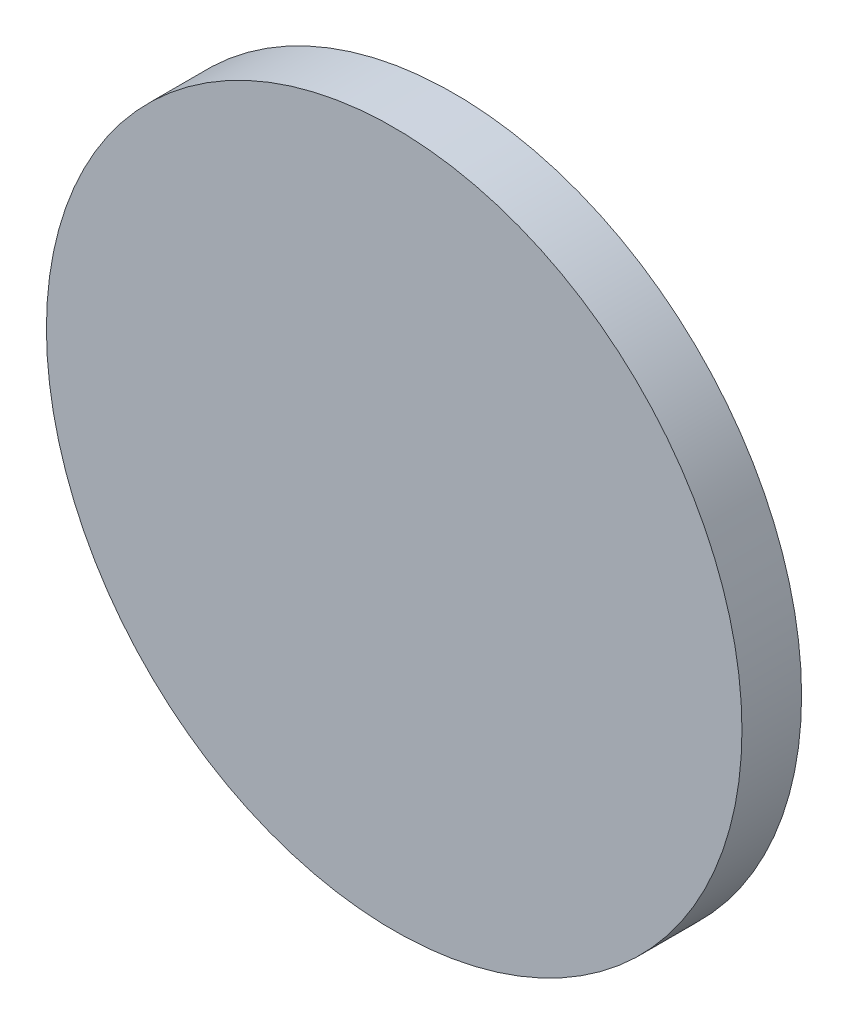
ISO-10303-21;
HEADER;
FILE_DESCRIPTION(('STEP AP214'),'2;1');
FILE_NAME('part.step','',(''),(''),'','','');
FILE_SCHEMA(('AUTOMOTIVE_DESIGN { 1 0 10303 214 1 1 1 1 }'));
ENDSEC;
DATA;
#1=APPLICATION_CONTEXT('core data for automotive mechanical design processes');
#2=APPLICATION_PROTOCOL_DEFINITION('international standard','automotive_design',2000,#1);
#3=PRODUCT_CONTEXT('',#1,'mechanical');
#4=PRODUCT('Part','Part','',(#3));
#5=PRODUCT_RELATED_PRODUCT_CATEGORY('part','',(#4));
#6=PRODUCT_DEFINITION_FORMATION('','',#4);
#7=PRODUCT_DEFINITION_CONTEXT('part definition',#1,'design');
#8=PRODUCT_DEFINITION('design','',#6,#7);
#9=PRODUCT_DEFINITION_SHAPE('','',#8);
#10=(LENGTH_UNIT() NAMED_UNIT(*) SI_UNIT(.MILLI.,.METRE.));
#11=(NAMED_UNIT(*) PLANE_ANGLE_UNIT() SI_UNIT($,.RADIAN.));
#12=(NAMED_UNIT(*) SI_UNIT($,.STERADIAN.) SOLID_ANGLE_UNIT());
#13=UNCERTAINTY_MEASURE_WITH_UNIT(LENGTH_MEASURE(1.E-05),#10,'distance_accuracy_value','');
#14=(GEOMETRIC_REPRESENTATION_CONTEXT(3) GLOBAL_UNCERTAINTY_ASSIGNED_CONTEXT((#13)) GLOBAL_UNIT_ASSIGNED_CONTEXT((#10,
#11,#12)) REPRESENTATION_CONTEXT('',''));
#15=CARTESIAN_POINT('',(0.,0.,0.));
#16=DIRECTION('',(0.,0.,1.));
#17=DIRECTION('',(1.,0.,0.));
#18=AXIS2_PLACEMENT_3D('',#15,#16,#17);
#19=CARTESIAN_POINT('',(11.60008,8.700000014875,0.));
#20=DIRECTION('',(0.,0.,-1.));
#21=DIRECTION('',(-1.,0.,0.));
#22=AXIS2_PLACEMENT_3D('',#19,#20,#21);
#23=PLANE('',#22);
#24=CARTESIAN_POINT('',(11.60008,8.700000014875,0.));
#25=DIRECTION('',(0.,0.,1.));
#26=DIRECTION('',(1.,0.,0.));
#27=AXIS2_PLACEMENT_3D('',#24,#25,#26);
#28=CIRCLE('',#27,0.200024667);
#29=CARTESIAN_POINT('',(11.800104667,8.700000014875,0.));
#30=VERTEX_POINT('',#29);
#31=EDGE_CURVE('E18',#30,#30,#28,.T.);
#32=ORIENTED_EDGE('',*,*,#31,.F.);
#33=EDGE_LOOP('',(#32));
#34=FACE_BOUND('',#33,.T.);
#35=ADVANCED_FACE('F15',(#34),#23,.T.);
#36=CARTESIAN_POINT('',(11.60008,8.700000014875,0.));
#37=DIRECTION('',(0.,0.,1.));
#38=DIRECTION('',(1.,0.,0.));
#39=AXIS2_PLACEMENT_3D('',#36,#37,#38);
#40=CYLINDRICAL_SURFACE('',#39,0.200024667);
#41=CARTESIAN_POINT('',(11.60008,8.700000014875,0.03429));
#42=DIRECTION('',(0.,0.,1.));
#43=DIRECTION('',(1.,0.,0.));
#44=AXIS2_PLACEMENT_3D('',#41,#42,#43);
#45=CIRCLE('',#44,0.200024667);
#46=CARTESIAN_POINT('',(11.800104667,8.700000014875,0.03429));
#47=VERTEX_POINT('',#46);
#48=EDGE_CURVE('E10',#47,#47,#45,.T.);
#49=ORIENTED_EDGE('',*,*,#48,.F.);
#50=EDGE_LOOP('',(#49));
#51=FACE_BOUND('',#50,.T.);
#52=ORIENTED_EDGE('',*,*,#31,.T.);
#53=EDGE_LOOP('',(#52));
#54=FACE_BOUND('',#53,.T.);
#55=ADVANCED_FACE('F27',(#51,#54),#40,.T.);
#56=CARTESIAN_POINT('',(11.60008,8.700000014875,0.03429));
#57=DIRECTION('',(0.,0.,1.));
#58=DIRECTION('',(1.,0.,0.));
#59=AXIS2_PLACEMENT_3D('',#56,#57,#58);
#60=PLANE('',#59);
#61=ORIENTED_EDGE('',*,*,#48,.T.);
#62=EDGE_LOOP('',(#61));
#63=FACE_BOUND('',#62,.T.);
#64=ADVANCED_FACE('F34',(#63),#60,.T.);
#65=CLOSED_SHELL('',(#35,#55,#64));
#66=MANIFOLD_SOLID_BREP('B1',#65);
#67=ADVANCED_BREP_SHAPE_REPRESENTATION('',(#18,#66),#14);
#68=SHAPE_DEFINITION_REPRESENTATION(#9,#67);
ENDSEC;
END-ISO-10303-21;
